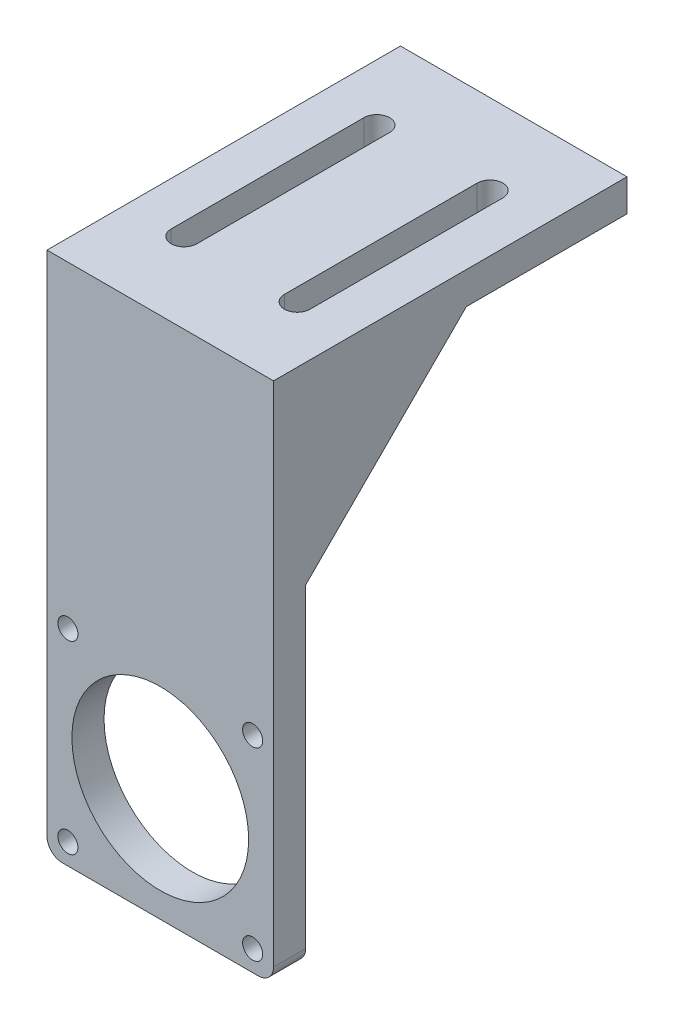
ISO-10303-21;
HEADER;
FILE_DESCRIPTION(('STEP AP214'),'2;1');
FILE_NAME('part.step','',(''),(''),'','','');
FILE_SCHEMA(('AUTOMOTIVE_DESIGN { 1 0 10303 214 1 1 1 1 }'));
ENDSEC;
DATA;
#1=APPLICATION_CONTEXT('core data for automotive mechanical design processes');
#2=APPLICATION_PROTOCOL_DEFINITION('international standard','automotive_design',2000,#1);
#3=PRODUCT_CONTEXT('',#1,'mechanical');
#4=PRODUCT('Part','Part','',(#3));
#5=PRODUCT_RELATED_PRODUCT_CATEGORY('part','',(#4));
#6=PRODUCT_DEFINITION_FORMATION('','',#4);
#7=PRODUCT_DEFINITION_CONTEXT('part definition',#1,'design');
#8=PRODUCT_DEFINITION('design','',#6,#7);
#9=PRODUCT_DEFINITION_SHAPE('','',#8);
#10=(LENGTH_UNIT() NAMED_UNIT(*) SI_UNIT(.MILLI.,.METRE.));
#11=(NAMED_UNIT(*) PLANE_ANGLE_UNIT() SI_UNIT($,.RADIAN.));
#12=(NAMED_UNIT(*) SI_UNIT($,.STERADIAN.) SOLID_ANGLE_UNIT());
#13=UNCERTAINTY_MEASURE_WITH_UNIT(LENGTH_MEASURE(1.E-05),#10,'distance_accuracy_value','');
#14=(GEOMETRIC_REPRESENTATION_CONTEXT(3) GLOBAL_UNCERTAINTY_ASSIGNED_CONTEXT((#13)) GLOBAL_UNIT_ASSIGNED_CONTEXT((#10,
#11,#12)) REPRESENTATION_CONTEXT('',''));
#15=CARTESIAN_POINT('',(0.,0.,0.));
#16=DIRECTION('',(0.,0.,1.));
#17=DIRECTION('',(1.,0.,0.));
#18=AXIS2_PLACEMENT_3D('',#15,#16,#17);
#19=CARTESIAN_POINT('',(-11.8505836409526,-14.3327512447559,0.));
#20=DIRECTION('',(0.,0.,-1.));
#21=DIRECTION('',(-1.,0.,0.));
#22=AXIS2_PLACEMENT_3D('',#19,#20,#21);
#23=PLANE('',#22);
#24=CARTESIAN_POINT('',(11.8492570349978,-13.6329105688056,0.));
#25=DIRECTION('',(0.,0.,1.));
#26=DIRECTION('',(1.,0.,0.));
#27=AXIS2_PLACEMENT_3D('',#24,#25,#26);
#28=CIRCLE('',#27,1.25);
#29=CARTESIAN_POINT('',(13.0992570349978,-13.6329105688056,0.));
#30=VERTEX_POINT('',#29);
#31=EDGE_CURVE('E301',#30,#30,#28,.T.);
#32=ORIENTED_EDGE('',*,*,#31,.T.);
#33=EDGE_LOOP('',(#32));
#34=FACE_BOUND('',#33,.T.);
#35=CARTESIAN_POINT('',(11.8492570349978,9.3670894311944,0.));
#36=DIRECTION('',(0.,0.,1.));
#37=DIRECTION('',(-1.,0.,0.));
#38=AXIS2_PLACEMENT_3D('',#35,#36,#37);
#39=CIRCLE('',#38,1.25);
#40=CARTESIAN_POINT('',(10.5992570349978,9.3670894311944,0.));
#41=VERTEX_POINT('',#40);
#42=EDGE_CURVE('E313',#41,#41,#39,.T.);
#43=ORIENTED_EDGE('',*,*,#42,.T.);
#44=EDGE_LOOP('',(#43));
#45=FACE_BOUND('',#44,.T.);
#46=CARTESIAN_POINT('',(-11.1507429650022,9.3670894311944,0.));
#47=DIRECTION('',(0.,0.,1.));
#48=DIRECTION('',(1.,0.,0.));
#49=AXIS2_PLACEMENT_3D('',#46,#47,#48);
#50=CIRCLE('',#49,1.25);
#51=CARTESIAN_POINT('',(-9.90074296500222,9.3670894311944,0.));
#52=VERTEX_POINT('',#51);
#53=EDGE_CURVE('E319',#52,#52,#50,.T.);
#54=ORIENTED_EDGE('',*,*,#53,.T.);
#55=EDGE_LOOP('',(#54));
#56=FACE_BOUND('',#55,.T.);
#57=CARTESIAN_POINT('',(-11.1507429650022,-13.6329105688056,0.));
#58=DIRECTION('',(0.,0.,1.));
#59=DIRECTION('',(-1.,0.,0.));
#60=AXIS2_PLACEMENT_3D('',#57,#58,#59);
#61=CIRCLE('',#60,1.25);
#62=CARTESIAN_POINT('',(-12.4007429650022,-13.6329105688056,0.));
#63=VERTEX_POINT('',#62);
#64=EDGE_CURVE('E307',#63,#63,#61,.T.);
#65=ORIENTED_EDGE('',*,*,#64,.T.);
#66=EDGE_LOOP('',(#65));
#67=FACE_BOUND('',#66,.T.);
#68=CARTESIAN_POINT('',(0.349257034997781,-2.13291056880559,0.));
#69=DIRECTION('',(0.,0.,1.));
#70=DIRECTION('',(1.,0.,0.));
#71=AXIS2_PLACEMENT_3D('',#68,#69,#70);
#72=CIRCLE('',#71,11.);
#73=CARTESIAN_POINT('',(11.3492570349978,-2.13291056880559,0.));
#74=VERTEX_POINT('',#73);
#75=EDGE_CURVE('E281',#74,#74,#72,.T.);
#76=ORIENTED_EDGE('',*,*,#75,.T.);
#77=EDGE_LOOP('',(#76));
#78=FACE_BOUND('',#77,.T.);
#79=DIRECTION('',(0.,-1.,0.));
#80=VECTOR('',#79,1.);
#81=CARTESIAN_POINT('',(-13.7507429650022,44.8670894311944,0.));
#82=LINE('',#81,#80);
#83=CARTESIAN_POINT('',(-13.7507429650022,24.8670894311944,0.));
#84=VERTEX_POINT('',#83);
#85=CARTESIAN_POINT('',(-13.7507429650022,-14.3327512447559,0.));
#86=VERTEX_POINT('',#85);
#87=EDGE_CURVE('E57',#84,#86,#82,.T.);
#88=ORIENTED_EDGE('',*,*,#87,.F.);
#89=DIRECTION('',(-1.,0.,0.));
#90=VECTOR('',#89,1.);
#91=CARTESIAN_POINT('',(-11.7507429650022,24.8670894311944,0.));
#92=LINE('',#91,#90);
#93=CARTESIAN_POINT('',(-11.7507429650022,24.8670894311944,0.));
#94=VERTEX_POINT('',#93);
#95=EDGE_CURVE('E52',#94,#84,#92,.T.);
#96=ORIENTED_EDGE('',*,*,#95,.F.);
#97=DIRECTION('',(0.,-1.,0.));
#98=VECTOR('',#97,1.);
#99=CARTESIAN_POINT('',(-11.7507429650022,44.8670894311944,0.));
#100=LINE('',#99,#98);
#101=CARTESIAN_POINT('',(-11.7507429650022,44.8670894311944,0.));
#102=VERTEX_POINT('',#101);
#103=EDGE_CURVE('E199',#102,#94,#100,.T.);
#104=ORIENTED_EDGE('',*,*,#103,.F.);
#105=DIRECTION('',(-1.,0.,0.));
#106=VECTOR('',#105,1.);
#107=CARTESIAN_POINT('',(14.4492570349978,44.8670894311944,0.));
#108=LINE('',#107,#106);
#109=CARTESIAN_POINT('',(12.4492570349978,44.8670894311944,0.));
#110=VERTEX_POINT('',#109);
#111=EDGE_CURVE('E346',#110,#102,#108,.T.);
#112=ORIENTED_EDGE('',*,*,#111,.F.);
#113=DIRECTION('',(0.,-1.,0.));
#114=VECTOR('',#113,1.);
#115=CARTESIAN_POINT('',(12.4492570349978,44.8670894311944,0.));
#116=LINE('',#115,#114);
#117=CARTESIAN_POINT('',(12.4492570349978,24.8670894311944,0.));
#118=VERTEX_POINT('',#117);
#119=EDGE_CURVE('E210',#110,#118,#116,.T.);
#120=ORIENTED_EDGE('',*,*,#119,.T.);
#121=DIRECTION('',(1.,0.,0.));
#122=VECTOR('',#121,1.);
#123=CARTESIAN_POINT('',(12.4492570349978,24.8670894311944,0.));
#124=LINE('',#123,#122);
#125=CARTESIAN_POINT('',(14.4492570349978,24.8670894311944,0.));
#126=VERTEX_POINT('',#125);
#127=EDGE_CURVE('E215',#118,#126,#124,.T.);
#128=ORIENTED_EDGE('',*,*,#127,.T.);
#129=DIRECTION('',(0.,1.,0.));
#130=VECTOR('',#129,1.);
#131=CARTESIAN_POINT('',(14.4492570349978,-14.3327512447559,0.));
#132=LINE('',#131,#130);
#133=CARTESIAN_POINT('',(14.4492570349978,-14.3327512447559,0.));
#134=VERTEX_POINT('',#133);
#135=EDGE_CURVE('E343',#134,#126,#132,.T.);
#136=ORIENTED_EDGE('',*,*,#135,.F.);
#137=CARTESIAN_POINT('',(12.5490977109481,-14.3327512447559,0.));
#138=DIRECTION('',(0.,0.,1.));
#139=DIRECTION('',(1.,0.,0.));
#140=AXIS2_PLACEMENT_3D('',#137,#138,#139);
#141=CIRCLE('',#140,1.90015932404967);
#142=CARTESIAN_POINT('',(12.5490977109481,-16.2329105688056,0.));
#143=VERTEX_POINT('',#142);
#144=EDGE_CURVE('E341',#143,#134,#141,.T.);
#145=ORIENTED_EDGE('',*,*,#144,.F.);
#146=DIRECTION('',(1.,0.,0.));
#147=VECTOR('',#146,1.);
#148=CARTESIAN_POINT('',(0.349257034997781,-16.2329105688056,0.));
#149=LINE('',#148,#147);
#150=CARTESIAN_POINT('',(-11.8505836409525,-16.2329105688056,0.));
#151=VERTEX_POINT('',#150);
#152=EDGE_CURVE('E325',#151,#143,#149,.T.);
#153=ORIENTED_EDGE('',*,*,#152,.F.);
#154=CARTESIAN_POINT('',(-11.8505836409526,-14.3327512447559,0.));
#155=DIRECTION('',(0.,0.,1.));
#156=DIRECTION('',(-1.,0.,0.));
#157=AXIS2_PLACEMENT_3D('',#154,#155,#156);
#158=CIRCLE('',#157,1.90015932404967);
#159=EDGE_CURVE('E331',#86,#151,#158,.T.);
#160=ORIENTED_EDGE('',*,*,#159,.F.);
#161=EDGE_LOOP('',(#88,#96,#104,#112,#120,#128,#136,#145,#153,#160));
#162=FACE_BOUND('',#161,.T.);
#163=ADVANCED_FACE('F37',(#34,#45,#56,#67,#78,#162),#23,.T.);
#164=CARTESIAN_POINT('',(0.,44.8670894311944,0.));
#165=DIRECTION('',(0.,1.,0.));
#166=DIRECTION('',(0.,0.,1.));
#167=AXIS2_PLACEMENT_3D('',#164,#165,#166);
#168=PLANE('',#167);
#169=CARTESIAN_POINT('',(7.39925703499778,44.8670894311944,-30.));
#170=DIRECTION('',(0.,1.,0.));
#171=DIRECTION('',(0.,0.,1.));
#172=AXIS2_PLACEMENT_3D('',#169,#170,#171);
#173=CIRCLE('',#172,1.6);
#174=CARTESIAN_POINT('',(8.99925703499778,44.8670894311944,-30.));
#175=VERTEX_POINT('',#174);
#176=CARTESIAN_POINT('',(5.79925703499778,44.8670894311944,-30.));
#177=VERTEX_POINT('',#176);
#178=EDGE_CURVE('E262',#175,#177,#173,.T.);
#179=ORIENTED_EDGE('',*,*,#178,.T.);
#180=DIRECTION('',(0.,0.,-1.));
#181=VECTOR('',#180,1.);
#182=CARTESIAN_POINT('',(5.79925703499778,44.8670894311944,0.));
#183=LINE('',#182,#181);
#184=CARTESIAN_POINT('',(5.79925703499778,44.8670894311944,-6.));
#185=VERTEX_POINT('',#184);
#186=EDGE_CURVE('E271',#185,#177,#183,.T.);
#187=ORIENTED_EDGE('',*,*,#186,.F.);
#188=CARTESIAN_POINT('',(7.39925703499778,44.8670894311944,-6.));
#189=DIRECTION('',(0.,1.,0.));
#190=DIRECTION('',(0.,0.,1.));
#191=AXIS2_PLACEMENT_3D('',#188,#189,#190);
#192=CIRCLE('',#191,1.6);
#193=CARTESIAN_POINT('',(8.99925703499778,44.8670894311944,-6.));
#194=VERTEX_POINT('',#193);
#195=EDGE_CURVE('E268',#194,#185,#192,.F.);
#196=ORIENTED_EDGE('',*,*,#195,.F.);
#197=DIRECTION('',(0.,0.,-1.));
#198=VECTOR('',#197,1.);
#199=CARTESIAN_POINT('',(8.99925703499778,44.8670894311944,0.));
#200=LINE('',#199,#198);
#201=EDGE_CURVE('E265',#194,#175,#200,.T.);
#202=ORIENTED_EDGE('',*,*,#201,.T.);
#203=EDGE_LOOP('',(#179,#187,#196,#202));
#204=FACE_BOUND('',#203,.T.);
#205=CARTESIAN_POINT('',(-6.70074296500222,44.8670894311944,-6.));
#206=DIRECTION('',(0.,1.,0.));
#207=DIRECTION('',(0.,0.,1.));
#208=AXIS2_PLACEMENT_3D('',#205,#206,#207);
#209=CIRCLE('',#208,1.6);
#210=CARTESIAN_POINT('',(-8.30074296500222,44.8670894311944,-6.));
#211=VERTEX_POINT('',#210);
#212=CARTESIAN_POINT('',(-5.10074296500222,44.8670894311944,-6.));
#213=VERTEX_POINT('',#212);
#214=EDGE_CURVE('E217',#211,#213,#209,.T.);
#215=ORIENTED_EDGE('',*,*,#214,.T.);
#216=DIRECTION('',(0.,0.,-1.));
#217=VECTOR('',#216,1.);
#218=CARTESIAN_POINT('',(-5.10074296500222,44.8670894311944,0.));
#219=LINE('',#218,#217);
#220=CARTESIAN_POINT('',(-5.10074296500222,44.8670894311944,-30.));
#221=VERTEX_POINT('',#220);
#222=EDGE_CURVE('E259',#213,#221,#219,.T.);
#223=ORIENTED_EDGE('',*,*,#222,.T.);
#224=CARTESIAN_POINT('',(-6.70074296500222,44.8670894311944,-30.));
#225=DIRECTION('',(0.,1.,0.));
#226=DIRECTION('',(0.,0.,1.));
#227=AXIS2_PLACEMENT_3D('',#224,#225,#226);
#228=CIRCLE('',#227,1.6);
#229=CARTESIAN_POINT('',(-8.30074296500222,44.8670894311944,-30.));
#230=VERTEX_POINT('',#229);
#231=EDGE_CURVE('E256',#230,#221,#228,.F.);
#232=ORIENTED_EDGE('',*,*,#231,.F.);
#233=DIRECTION('',(0.,0.,-1.));
#234=VECTOR('',#233,1.);
#235=CARTESIAN_POINT('',(-8.30074296500222,44.8670894311944,0.));
#236=LINE('',#235,#234);
#237=EDGE_CURVE('E254',#211,#230,#236,.T.);
#238=ORIENTED_EDGE('',*,*,#237,.F.);
#239=EDGE_LOOP('',(#215,#223,#232,#238));
#240=FACE_BOUND('',#239,.T.);
#241=DIRECTION('',(-1.,0.,0.));
#242=VECTOR('',#241,1.);
#243=CARTESIAN_POINT('',(-11.7507429650022,44.8670894311944,-20.));
#244=LINE('',#243,#242);
#245=CARTESIAN_POINT('',(-11.7507429650022,44.8670894311944,-20.));
#246=VERTEX_POINT('',#245);
#247=CARTESIAN_POINT('',(-13.7507429650022,44.8670894311944,-20.));
#248=VERTEX_POINT('',#247);
#249=EDGE_CURVE('E186',#246,#248,#244,.T.);
#250=ORIENTED_EDGE('',*,*,#249,.T.);
#251=DIRECTION('',(0.,0.,-1.));
#252=VECTOR('',#251,1.);
#253=CARTESIAN_POINT('',(-13.7507429650022,44.8670894311944,0.));
#254=LINE('',#253,#252);
#255=CARTESIAN_POINT('',(-13.7507429650022,44.8670894311944,-40.));
#256=VERTEX_POINT('',#255);
#257=EDGE_CURVE('E172',#248,#256,#254,.T.);
#258=ORIENTED_EDGE('',*,*,#257,.T.);
#259=DIRECTION('',(1.,0.,0.));
#260=VECTOR('',#259,1.);
#261=CARTESIAN_POINT('',(0.,44.8670894311944,-40.));
#262=LINE('',#261,#260);
#263=CARTESIAN_POINT('',(14.4492570349978,44.8670894311944,-40.));
#264=VERTEX_POINT('',#263);
#265=EDGE_CURVE('E183',#256,#264,#262,.T.);
#266=ORIENTED_EDGE('',*,*,#265,.T.);
#267=DIRECTION('',(0.,0.,1.));
#268=VECTOR('',#267,1.);
#269=CARTESIAN_POINT('',(14.4492570349978,44.8670894311944,0.));
#270=LINE('',#269,#268);
#271=CARTESIAN_POINT('',(14.4492570349978,44.8670894311944,-20.));
#272=VERTEX_POINT('',#271);
#273=EDGE_CURVE('E274',#264,#272,#270,.T.);
#274=ORIENTED_EDGE('',*,*,#273,.T.);
#275=DIRECTION('',(1.,0.,0.));
#276=VECTOR('',#275,1.);
#277=CARTESIAN_POINT('',(12.4492570349978,44.8670894311944,-20.));
#278=LINE('',#277,#276);
#279=CARTESIAN_POINT('',(12.4492570349978,44.8670894311944,-20.));
#280=VERTEX_POINT('',#279);
#281=EDGE_CURVE('E212',#280,#272,#278,.T.);
#282=ORIENTED_EDGE('',*,*,#281,.F.);
#283=DIRECTION('',(0.,0.,1.));
#284=VECTOR('',#283,1.);
#285=CARTESIAN_POINT('',(12.4492570349978,44.8670894311944,-20.));
#286=LINE('',#285,#284);
#287=EDGE_CURVE('E208',#280,#110,#286,.T.);
#288=ORIENTED_EDGE('',*,*,#287,.T.);
#289=ORIENTED_EDGE('',*,*,#111,.T.);
#290=DIRECTION('',(0.,0.,1.));
#291=VECTOR('',#290,1.);
#292=CARTESIAN_POINT('',(-11.7507429650022,44.8670894311944,-20.));
#293=LINE('',#292,#291);
#294=EDGE_CURVE('E190',#246,#102,#293,.T.);
#295=ORIENTED_EDGE('',*,*,#294,.F.);
#296=EDGE_LOOP('',(#250,#258,#266,#274,#282,#288,#289,#295));
#297=FACE_BOUND('',#296,.T.);
#298=ADVANCED_FACE('F187',(#204,#240,#297),#168,.F.);
#299=CARTESIAN_POINT('',(-11.8505836409526,-14.3327512447559,4.));
#300=DIRECTION('',(0.,0.,-1.));
#301=DIRECTION('',(-1.,0.,0.));
#302=AXIS2_PLACEMENT_3D('',#299,#300,#301);
#303=PLANE('',#302);
#304=DIRECTION('',(1.,0.,0.));
#305=VECTOR('',#304,1.);
#306=CARTESIAN_POINT('',(0.349257034997781,-16.2329105688056,4.));
#307=LINE('',#306,#305);
#308=CARTESIAN_POINT('',(-11.8505836409525,-16.2329105688056,4.));
#309=VERTEX_POINT('',#308);
#310=CARTESIAN_POINT('',(12.5490977109481,-16.2329105688056,4.));
#311=VERTEX_POINT('',#310);
#312=EDGE_CURVE('E328',#309,#311,#307,.T.);
#313=ORIENTED_EDGE('',*,*,#312,.T.);
#314=CARTESIAN_POINT('',(12.5490977109481,-14.3327512447559,4.));
#315=DIRECTION('',(0.,0.,1.));
#316=DIRECTION('',(1.,0.,0.));
#317=AXIS2_PLACEMENT_3D('',#314,#315,#316);
#318=CIRCLE('',#317,1.90015932404967);
#319=CARTESIAN_POINT('',(14.4492570349978,-14.3327512447559,4.));
#320=VERTEX_POINT('',#319);
#321=EDGE_CURVE('E330',#311,#320,#318,.T.);
#322=ORIENTED_EDGE('',*,*,#321,.T.);
#323=DIRECTION('',(0.,1.,0.));
#324=VECTOR('',#323,1.);
#325=CARTESIAN_POINT('',(14.4492570349978,-14.3327512447559,4.));
#326=LINE('',#325,#324);
#327=CARTESIAN_POINT('',(14.4492570349978,48.8670894311944,4.));
#328=VERTEX_POINT('',#327);
#329=EDGE_CURVE('E333',#320,#328,#326,.T.);
#330=ORIENTED_EDGE('',*,*,#329,.T.);
#331=DIRECTION('',(-1.,0.,0.));
#332=VECTOR('',#331,1.);
#333=CARTESIAN_POINT('',(0.,48.8670894311944,4.));
#334=LINE('',#333,#332);
#335=CARTESIAN_POINT('',(-13.7507429650022,48.8670894311944,4.));
#336=VERTEX_POINT('',#335);
#337=EDGE_CURVE('E248',#328,#336,#334,.T.);
#338=ORIENTED_EDGE('',*,*,#337,.T.);
#339=DIRECTION('',(0.,-1.,0.));
#340=VECTOR('',#339,1.);
#341=CARTESIAN_POINT('',(-13.7507429650022,44.8670894311944,4.));
#342=LINE('',#341,#340);
#343=CARTESIAN_POINT('',(-13.7507429650022,-14.3327512447559,4.));
#344=VERTEX_POINT('',#343);
#345=EDGE_CURVE('E335',#336,#344,#342,.T.);
#346=ORIENTED_EDGE('',*,*,#345,.T.);
#347=CARTESIAN_POINT('',(-11.8505836409526,-14.3327512447559,4.));
#348=DIRECTION('',(0.,0.,1.));
#349=DIRECTION('',(-1.,0.,0.));
#350=AXIS2_PLACEMENT_3D('',#347,#348,#349);
#351=CIRCLE('',#350,1.90015932404967);
#352=EDGE_CURVE('E337',#344,#309,#351,.T.);
#353=ORIENTED_EDGE('',*,*,#352,.T.);
#354=EDGE_LOOP('',(#313,#322,#330,#338,#346,#353));
#355=FACE_BOUND('',#354,.T.);
#356=CARTESIAN_POINT('',(-11.1507429650022,9.3670894311944,4.));
#357=DIRECTION('',(0.,0.,1.));
#358=DIRECTION('',(1.,0.,0.));
#359=AXIS2_PLACEMENT_3D('',#356,#357,#358);
#360=CIRCLE('',#359,1.25);
#361=CARTESIAN_POINT('',(-9.90074296500222,9.3670894311944,4.));
#362=VERTEX_POINT('',#361);
#363=EDGE_CURVE('E322',#362,#362,#360,.T.);
#364=ORIENTED_EDGE('',*,*,#363,.F.);
#365=EDGE_LOOP('',(#364));
#366=FACE_BOUND('',#365,.T.);
#367=CARTESIAN_POINT('',(11.8492570349978,9.3670894311944,4.));
#368=DIRECTION('',(0.,0.,1.));
#369=DIRECTION('',(-1.,0.,0.));
#370=AXIS2_PLACEMENT_3D('',#367,#368,#369);
#371=CIRCLE('',#370,1.25);
#372=CARTESIAN_POINT('',(10.5992570349978,9.3670894311944,4.));
#373=VERTEX_POINT('',#372);
#374=EDGE_CURVE('E316',#373,#373,#371,.T.);
#375=ORIENTED_EDGE('',*,*,#374,.F.);
#376=EDGE_LOOP('',(#375));
#377=FACE_BOUND('',#376,.T.);
#378=CARTESIAN_POINT('',(-11.1507429650022,-13.6329105688056,4.));
#379=DIRECTION('',(0.,0.,1.));
#380=DIRECTION('',(-1.,0.,0.));
#381=AXIS2_PLACEMENT_3D('',#378,#379,#380);
#382=CIRCLE('',#381,1.25);
#383=CARTESIAN_POINT('',(-12.4007429650022,-13.6329105688056,4.));
#384=VERTEX_POINT('',#383);
#385=EDGE_CURVE('E310',#384,#384,#382,.T.);
#386=ORIENTED_EDGE('',*,*,#385,.F.);
#387=EDGE_LOOP('',(#386));
#388=FACE_BOUND('',#387,.T.);
#389=CARTESIAN_POINT('',(11.8492570349978,-13.6329105688056,4.));
#390=DIRECTION('',(0.,0.,1.));
#391=DIRECTION('',(1.,0.,0.));
#392=AXIS2_PLACEMENT_3D('',#389,#390,#391);
#393=CIRCLE('',#392,1.25);
#394=CARTESIAN_POINT('',(13.0992570349978,-13.6329105688056,4.));
#395=VERTEX_POINT('',#394);
#396=EDGE_CURVE('E304',#395,#395,#393,.T.);
#397=ORIENTED_EDGE('',*,*,#396,.F.);
#398=EDGE_LOOP('',(#397));
#399=FACE_BOUND('',#398,.T.);
#400=CARTESIAN_POINT('',(0.349257034997781,-2.13291056880559,4.));
#401=DIRECTION('',(0.,0.,1.));
#402=DIRECTION('',(1.,0.,0.));
#403=AXIS2_PLACEMENT_3D('',#400,#401,#402);
#404=CIRCLE('',#403,11.);
#405=CARTESIAN_POINT('',(11.3492570349978,-2.13291056880559,4.));
#406=VERTEX_POINT('',#405);
#407=EDGE_CURVE('E298',#406,#406,#404,.T.);
#408=ORIENTED_EDGE('',*,*,#407,.F.);
#409=EDGE_LOOP('',(#408));
#410=FACE_BOUND('',#409,.T.);
#411=ADVANCED_FACE('F388',(#355,#366,#377,#388,#399,#410),#303,.F.);
#412=CARTESIAN_POINT('',(0.349257034997781,-16.2329105688056,4.));
#413=DIRECTION('',(0.,1.,0.));
#414=DIRECTION('',(0.,0.,1.));
#415=AXIS2_PLACEMENT_3D('',#412,#413,#414);
#416=PLANE('',#415);
#417=ORIENTED_EDGE('',*,*,#152,.T.);
#418=DIRECTION('',(0.,0.,-1.));
#419=VECTOR('',#418,1.);
#420=CARTESIAN_POINT('',(12.5490977109481,-16.2329105688056,4.));
#421=LINE('',#420,#419);
#422=EDGE_CURVE('E11',#311,#143,#421,.T.);
#423=ORIENTED_EDGE('',*,*,#422,.F.);
#424=ORIENTED_EDGE('',*,*,#312,.F.);
#425=DIRECTION('',(0.,0.,-1.));
#426=VECTOR('',#425,1.);
#427=CARTESIAN_POINT('',(-11.8505836409525,-16.2329105688056,4.));
#428=LINE('',#427,#426);
#429=EDGE_CURVE('E339',#309,#151,#428,.T.);
#430=ORIENTED_EDGE('',*,*,#429,.T.);
#431=EDGE_LOOP('',(#417,#423,#424,#430));
#432=FACE_BOUND('',#431,.T.);
#433=ADVANCED_FACE('F39',(#432),#416,.F.);
#434=CARTESIAN_POINT('',(12.5490977109481,-14.3327512447559,4.));
#435=DIRECTION('',(0.,0.,-1.));
#436=DIRECTION('',(-1.,0.,0.));
#437=AXIS2_PLACEMENT_3D('',#434,#435,#436);
#438=CYLINDRICAL_SURFACE('',#437,1.90015932404967);
#439=ORIENTED_EDGE('',*,*,#144,.T.);
#440=DIRECTION('',(0.,0.,-1.));
#441=VECTOR('',#440,1.);
#442=CARTESIAN_POINT('',(14.4492570349978,-14.3327512447559,4.));
#443=LINE('',#442,#441);
#444=EDGE_CURVE('E45',#320,#134,#443,.T.);
#445=ORIENTED_EDGE('',*,*,#444,.F.);
#446=ORIENTED_EDGE('',*,*,#321,.F.);
#447=ORIENTED_EDGE('',*,*,#422,.T.);
#448=EDGE_LOOP('',(#439,#445,#446,#447));
#449=FACE_BOUND('',#448,.T.);
#450=ADVANCED_FACE('F403',(#449),#438,.T.);
#451=CARTESIAN_POINT('',(14.4492570349978,-14.3327512447559,4.));
#452=DIRECTION('',(-1.,0.,0.));
#453=DIRECTION('',(0.,0.,1.));
#454=AXIS2_PLACEMENT_3D('',#451,#452,#453);
#455=PLANE('',#454);
#456=ORIENTED_EDGE('',*,*,#135,.T.);
#457=DIRECTION('',(0.,0.707106781186548,-0.707106781186548));
#458=VECTOR('',#457,1.);
#459=CARTESIAN_POINT('',(14.4492570349978,24.8670894311944,0.));
#460=LINE('',#459,#458);
#461=EDGE_CURVE('E194',#126,#272,#460,.T.);
#462=ORIENTED_EDGE('',*,*,#461,.T.);
#463=ORIENTED_EDGE('',*,*,#273,.F.);
#464=DIRECTION('',(0.,-1.,0.));
#465=VECTOR('',#464,1.);
#466=CARTESIAN_POINT('',(14.4492570349978,48.8670894311944,-40.));
#467=LINE('',#466,#465);
#468=CARTESIAN_POINT('',(14.4492570349978,48.8670894311944,-40.));
#469=VERTEX_POINT('',#468);
#470=EDGE_CURVE('E278',#469,#264,#467,.T.);
#471=ORIENTED_EDGE('',*,*,#470,.F.);
#472=DIRECTION('',(0.,0.,1.));
#473=VECTOR('',#472,1.);
#474=CARTESIAN_POINT('',(14.4492570349978,48.8670894311944,0.));
#475=LINE('',#474,#473);
#476=EDGE_CURVE('E240',#469,#328,#475,.T.);
#477=ORIENTED_EDGE('',*,*,#476,.T.);
#478=ORIENTED_EDGE('',*,*,#329,.F.);
#479=ORIENTED_EDGE('',*,*,#444,.T.);
#480=EDGE_LOOP('',(#456,#462,#463,#471,#477,#478,#479));
#481=FACE_BOUND('',#480,.T.);
#482=ADVANCED_FACE('F360',(#481),#455,.F.);
#483=CARTESIAN_POINT('',(-13.7507429650022,44.8670894311944,4.));
#484=DIRECTION('',(1.,0.,0.));
#485=DIRECTION('',(0.,0.,-1.));
#486=AXIS2_PLACEMENT_3D('',#483,#484,#485);
#487=PLANE('',#486);
#488=DIRECTION('',(0.,0.707106781186548,-0.707106781186548));
#489=VECTOR('',#488,1.);
#490=CARTESIAN_POINT('',(-13.7507429650022,24.8670894311944,0.));
#491=LINE('',#490,#489);
#492=EDGE_CURVE('E176',#84,#248,#491,.T.);
#493=ORIENTED_EDGE('',*,*,#492,.F.);
#494=ORIENTED_EDGE('',*,*,#87,.T.);
#495=DIRECTION('',(0.,0.,-1.));
#496=VECTOR('',#495,1.);
#497=CARTESIAN_POINT('',(-13.7507429650022,-14.3327512447559,4.));
#498=LINE('',#497,#496);
#499=EDGE_CURVE('E353',#344,#86,#498,.T.);
#500=ORIENTED_EDGE('',*,*,#499,.F.);
#501=ORIENTED_EDGE('',*,*,#345,.F.);
#502=DIRECTION('',(0.,0.,-1.));
#503=VECTOR('',#502,1.);
#504=CARTESIAN_POINT('',(-13.7507429650022,48.8670894311944,0.));
#505=LINE('',#504,#503);
#506=CARTESIAN_POINT('',(-13.7507429650022,48.8670894311944,-40.));
#507=VERTEX_POINT('',#506);
#508=EDGE_CURVE('E246',#336,#507,#505,.T.);
#509=ORIENTED_EDGE('',*,*,#508,.T.);
#510=DIRECTION('',(0.,-1.,0.));
#511=VECTOR('',#510,1.);
#512=CARTESIAN_POINT('',(-13.7507429650022,48.8670894311944,-40.));
#513=LINE('',#512,#511);
#514=EDGE_CURVE('E178',#507,#256,#513,.T.);
#515=ORIENTED_EDGE('',*,*,#514,.T.);
#516=ORIENTED_EDGE('',*,*,#257,.F.);
#517=EDGE_LOOP('',(#493,#494,#500,#501,#509,#515,#516));
#518=FACE_BOUND('',#517,.T.);
#519=ADVANCED_FACE('F174',(#518),#487,.F.);
#520=CARTESIAN_POINT('',(-11.8505836409526,-14.3327512447559,4.));
#521=DIRECTION('',(0.,0.,-1.));
#522=DIRECTION('',(-1.,0.,0.));
#523=AXIS2_PLACEMENT_3D('',#520,#521,#522);
#524=CYLINDRICAL_SURFACE('',#523,1.90015932404967);
#525=ORIENTED_EDGE('',*,*,#159,.T.);
#526=ORIENTED_EDGE('',*,*,#429,.F.);
#527=ORIENTED_EDGE('',*,*,#352,.F.);
#528=ORIENTED_EDGE('',*,*,#499,.T.);
#529=EDGE_LOOP('',(#525,#526,#527,#528));
#530=FACE_BOUND('',#529,.T.);
#531=ADVANCED_FACE('F395',(#530),#524,.T.);
#532=CARTESIAN_POINT('',(-11.1507429650022,9.3670894311944,4.));
#533=DIRECTION('',(0.,0.,-1.));
#534=DIRECTION('',(-1.,0.,0.));
#535=AXIS2_PLACEMENT_3D('',#532,#533,#534);
#536=CYLINDRICAL_SURFACE('',#535,1.25);
#537=ORIENTED_EDGE('',*,*,#363,.T.);
#538=EDGE_LOOP('',(#537));
#539=FACE_BOUND('',#538,.T.);
#540=ORIENTED_EDGE('',*,*,#53,.F.);
#541=EDGE_LOOP('',(#540));
#542=FACE_BOUND('',#541,.T.);
#543=ADVANCED_FACE('F398',(#539,#542),#536,.F.);
#544=CARTESIAN_POINT('',(11.8492570349978,9.3670894311944,4.));
#545=DIRECTION('',(0.,0.,-1.));
#546=DIRECTION('',(-1.,0.,0.));
#547=AXIS2_PLACEMENT_3D('',#544,#545,#546);
#548=CYLINDRICAL_SURFACE('',#547,1.25);
#549=ORIENTED_EDGE('',*,*,#374,.T.);
#550=EDGE_LOOP('',(#549));
#551=FACE_BOUND('',#550,.T.);
#552=ORIENTED_EDGE('',*,*,#42,.F.);
#553=EDGE_LOOP('',(#552));
#554=FACE_BOUND('',#553,.T.);
#555=ADVANCED_FACE('F474',(#551,#554),#548,.F.);
#556=CARTESIAN_POINT('',(-11.1507429650022,-13.6329105688056,4.));
#557=DIRECTION('',(0.,0.,-1.));
#558=DIRECTION('',(-1.,0.,0.));
#559=AXIS2_PLACEMENT_3D('',#556,#557,#558);
#560=CYLINDRICAL_SURFACE('',#559,1.25);
#561=ORIENTED_EDGE('',*,*,#385,.T.);
#562=EDGE_LOOP('',(#561));
#563=FACE_BOUND('',#562,.T.);
#564=ORIENTED_EDGE('',*,*,#64,.F.);
#565=EDGE_LOOP('',(#564));
#566=FACE_BOUND('',#565,.T.);
#567=ADVANCED_FACE('F470',(#563,#566),#560,.F.);
#568=CARTESIAN_POINT('',(11.8492570349978,-13.6329105688056,4.));
#569=DIRECTION('',(0.,0.,-1.));
#570=DIRECTION('',(-1.,0.,0.));
#571=AXIS2_PLACEMENT_3D('',#568,#569,#570);
#572=CYLINDRICAL_SURFACE('',#571,1.25);
#573=ORIENTED_EDGE('',*,*,#396,.T.);
#574=EDGE_LOOP('',(#573));
#575=FACE_BOUND('',#574,.T.);
#576=ORIENTED_EDGE('',*,*,#31,.F.);
#577=EDGE_LOOP('',(#576));
#578=FACE_BOUND('',#577,.T.);
#579=ADVANCED_FACE('F436',(#575,#578),#572,.F.);
#580=CARTESIAN_POINT('',(0.349257034997781,-2.13291056880559,4.));
#581=DIRECTION('',(0.,0.,-1.));
#582=DIRECTION('',(-1.,0.,0.));
#583=AXIS2_PLACEMENT_3D('',#580,#581,#582);
#584=CYLINDRICAL_SURFACE('',#583,11.);
#585=ORIENTED_EDGE('',*,*,#407,.T.);
#586=EDGE_LOOP('',(#585));
#587=FACE_BOUND('',#586,.T.);
#588=ORIENTED_EDGE('',*,*,#75,.F.);
#589=EDGE_LOOP('',(#588));
#590=FACE_BOUND('',#589,.T.);
#591=ADVANCED_FACE('F427',(#587,#590),#584,.F.);
#592=CARTESIAN_POINT('',(0.,48.8670894311944,-40.));
#593=DIRECTION('',(0.,0.,-1.));
#594=DIRECTION('',(-1.,0.,0.));
#595=AXIS2_PLACEMENT_3D('',#592,#593,#594);
#596=PLANE('',#595);
#597=ORIENTED_EDGE('',*,*,#265,.F.);
#598=ORIENTED_EDGE('',*,*,#514,.F.);
#599=DIRECTION('',(1.,0.,0.));
#600=VECTOR('',#599,1.);
#601=CARTESIAN_POINT('',(0.,48.8670894311944,-40.));
#602=LINE('',#601,#600);
#603=EDGE_CURVE('E243',#507,#469,#602,.T.);
#604=ORIENTED_EDGE('',*,*,#603,.T.);
#605=ORIENTED_EDGE('',*,*,#470,.T.);
#606=EDGE_LOOP('',(#597,#598,#604,#605));
#607=FACE_BOUND('',#606,.T.);
#608=ADVANCED_FACE('F424',(#607),#596,.T.);
#609=CARTESIAN_POINT('',(7.39925703499778,48.8670894311944,-30.));
#610=DIRECTION('',(0.,-1.,0.));
#611=DIRECTION('',(0.,0.,-1.));
#612=AXIS2_PLACEMENT_3D('',#609,#610,#611);
#613=CYLINDRICAL_SURFACE('',#612,1.6);
#614=ORIENTED_EDGE('',*,*,#178,.F.);
#615=DIRECTION('',(0.,-1.,0.));
#616=VECTOR('',#615,1.);
#617=CARTESIAN_POINT('',(8.99925703499778,48.8670894311944,-30.));
#618=LINE('',#617,#616);
#619=CARTESIAN_POINT('',(8.99925703499778,48.8670894311944,-30.));
#620=VERTEX_POINT('',#619);
#621=EDGE_CURVE('E279',#620,#175,#618,.T.);
#622=ORIENTED_EDGE('',*,*,#621,.F.);
#623=CARTESIAN_POINT('',(7.39925703499778,48.8670894311944,-30.));
#624=DIRECTION('',(0.,1.,0.));
#625=DIRECTION('',(0.,0.,1.));
#626=AXIS2_PLACEMENT_3D('',#623,#624,#625);
#627=CIRCLE('',#626,1.6);
#628=CARTESIAN_POINT('',(5.79925703499778,48.8670894311944,-30.));
#629=VERTEX_POINT('',#628);
#630=EDGE_CURVE('E229',#620,#629,#627,.T.);
#631=ORIENTED_EDGE('',*,*,#630,.T.);
#632=DIRECTION('',(0.,-1.,0.));
#633=VECTOR('',#632,1.);
#634=CARTESIAN_POINT('',(5.79925703499778,48.8670894311944,-30.));
#635=LINE('',#634,#633);
#636=EDGE_CURVE('E282',#629,#177,#635,.T.);
#637=ORIENTED_EDGE('',*,*,#636,.T.);
#638=EDGE_LOOP('',(#614,#622,#631,#637));
#639=FACE_BOUND('',#638,.T.);
#640=ADVANCED_FACE('F426',(#639),#613,.F.);
#641=CARTESIAN_POINT('',(8.99925703499778,48.8670894311944,0.));
#642=DIRECTION('',(-1.,0.,0.));
#643=DIRECTION('',(0.,0.,1.));
#644=AXIS2_PLACEMENT_3D('',#641,#642,#643);
#645=PLANE('',#644);
#646=ORIENTED_EDGE('',*,*,#201,.F.);
#647=DIRECTION('',(0.,-1.,0.));
#648=VECTOR('',#647,1.);
#649=CARTESIAN_POINT('',(8.99925703499778,48.8670894311944,-6.));
#650=LINE('',#649,#648);
#651=CARTESIAN_POINT('',(8.99925703499778,48.8670894311944,-6.));
#652=VERTEX_POINT('',#651);
#653=EDGE_CURVE('E288',#652,#194,#650,.T.);
#654=ORIENTED_EDGE('',*,*,#653,.F.);
#655=DIRECTION('',(0.,0.,-1.));
#656=VECTOR('',#655,1.);
#657=CARTESIAN_POINT('',(8.99925703499778,48.8670894311944,0.));
#658=LINE('',#657,#656);
#659=EDGE_CURVE('E232',#652,#620,#658,.T.);
#660=ORIENTED_EDGE('',*,*,#659,.T.);
#661=ORIENTED_EDGE('',*,*,#621,.T.);
#662=EDGE_LOOP('',(#646,#654,#660,#661));
#663=FACE_BOUND('',#662,.T.);
#664=ADVANCED_FACE('F433',(#663),#645,.T.);
#665=CARTESIAN_POINT('',(7.39925703499778,48.8670894311944,-6.));
#666=DIRECTION('',(0.,-1.,0.));
#667=DIRECTION('',(0.,0.,-1.));
#668=AXIS2_PLACEMENT_3D('',#665,#666,#667);
#669=CYLINDRICAL_SURFACE('',#668,1.6);
#670=ORIENTED_EDGE('',*,*,#195,.T.);
#671=DIRECTION('',(0.,-1.,0.));
#672=VECTOR('',#671,1.);
#673=CARTESIAN_POINT('',(5.79925703499778,48.8670894311944,-6.));
#674=LINE('',#673,#672);
#675=CARTESIAN_POINT('',(5.79925703499778,48.8670894311944,-6.));
#676=VERTEX_POINT('',#675);
#677=EDGE_CURVE('E284',#676,#185,#674,.T.);
#678=ORIENTED_EDGE('',*,*,#677,.F.);
#679=CARTESIAN_POINT('',(7.39925703499778,48.8670894311944,-6.));
#680=DIRECTION('',(0.,1.,0.));
#681=DIRECTION('',(0.,0.,1.));
#682=AXIS2_PLACEMENT_3D('',#679,#680,#681);
#683=CIRCLE('',#682,1.6);
#684=EDGE_CURVE('E235',#652,#676,#683,.F.);
#685=ORIENTED_EDGE('',*,*,#684,.F.);
#686=ORIENTED_EDGE('',*,*,#653,.T.);
#687=EDGE_LOOP('',(#670,#678,#685,#686));
#688=FACE_BOUND('',#687,.T.);
#689=ADVANCED_FACE('F447',(#688),#669,.F.);
#690=CARTESIAN_POINT('',(-6.70074296500222,48.8670894311944,-6.));
#691=DIRECTION('',(0.,-1.,0.));
#692=DIRECTION('',(0.,0.,-1.));
#693=AXIS2_PLACEMENT_3D('',#690,#691,#692);
#694=CYLINDRICAL_SURFACE('',#693,1.6);
#695=ORIENTED_EDGE('',*,*,#214,.F.);
#696=DIRECTION('',(0.,-1.,0.));
#697=VECTOR('',#696,1.);
#698=CARTESIAN_POINT('',(-8.30074296500222,48.8670894311944,-6.));
#699=LINE('',#698,#697);
#700=CARTESIAN_POINT('',(-8.30074296500222,48.8670894311944,-6.));
#701=VERTEX_POINT('',#700);
#702=EDGE_CURVE('E285',#701,#211,#699,.T.);
#703=ORIENTED_EDGE('',*,*,#702,.F.);
#704=CARTESIAN_POINT('',(-6.70074296500222,48.8670894311944,-6.));
#705=DIRECTION('',(0.,1.,0.));
#706=DIRECTION('',(0.,0.,1.));
#707=AXIS2_PLACEMENT_3D('',#704,#705,#706);
#708=CIRCLE('',#707,1.6);
#709=CARTESIAN_POINT('',(-5.10074296500222,48.8670894311944,-6.));
#710=VERTEX_POINT('',#709);
#711=EDGE_CURVE('E182',#701,#710,#708,.T.);
#712=ORIENTED_EDGE('',*,*,#711,.T.);
#713=DIRECTION('',(0.,-1.,0.));
#714=VECTOR('',#713,1.);
#715=CARTESIAN_POINT('',(-5.10074296500222,48.8670894311944,-6.));
#716=LINE('',#715,#714);
#717=EDGE_CURVE('E251',#710,#213,#716,.T.);
#718=ORIENTED_EDGE('',*,*,#717,.T.);
#719=EDGE_LOOP('',(#695,#703,#712,#718));
#720=FACE_BOUND('',#719,.T.);
#721=ADVANCED_FACE('F450',(#720),#694,.F.);
#722=CARTESIAN_POINT('',(-8.30074296500222,48.8670894311944,0.));
#723=DIRECTION('',(-1.,0.,0.));
#724=DIRECTION('',(0.,0.,1.));
#725=AXIS2_PLACEMENT_3D('',#722,#723,#724);
#726=PLANE('',#725);
#727=ORIENTED_EDGE('',*,*,#237,.T.);
#728=DIRECTION('',(0.,-1.,0.));
#729=VECTOR('',#728,1.);
#730=CARTESIAN_POINT('',(-8.30074296500222,48.8670894311944,-30.));
#731=LINE('',#730,#729);
#732=CARTESIAN_POINT('',(-8.30074296500222,48.8670894311944,-30.));
#733=VERTEX_POINT('',#732);
#734=EDGE_CURVE('E294',#733,#230,#731,.T.);
#735=ORIENTED_EDGE('',*,*,#734,.F.);
#736=DIRECTION('',(0.,0.,-1.));
#737=VECTOR('',#736,1.);
#738=CARTESIAN_POINT('',(-8.30074296500222,48.8670894311944,0.));
#739=LINE('',#738,#737);
#740=EDGE_CURVE('E222',#701,#733,#739,.T.);
#741=ORIENTED_EDGE('',*,*,#740,.F.);
#742=ORIENTED_EDGE('',*,*,#702,.T.);
#743=EDGE_LOOP('',(#727,#735,#741,#742));
#744=FACE_BOUND('',#743,.T.);
#745=ADVANCED_FACE('F460',(#744),#726,.F.);
#746=CARTESIAN_POINT('',(-6.70074296500222,48.8670894311944,-30.));
#747=DIRECTION('',(0.,-1.,0.));
#748=DIRECTION('',(0.,0.,-1.));
#749=AXIS2_PLACEMENT_3D('',#746,#747,#748);
#750=CYLINDRICAL_SURFACE('',#749,1.6);
#751=ORIENTED_EDGE('',*,*,#231,.T.);
#752=DIRECTION('',(0.,-1.,0.));
#753=VECTOR('',#752,1.);
#754=CARTESIAN_POINT('',(-5.10074296500222,48.8670894311944,-30.));
#755=LINE('',#754,#753);
#756=CARTESIAN_POINT('',(-5.10074296500222,48.8670894311944,-30.));
#757=VERTEX_POINT('',#756);
#758=EDGE_CURVE('E292',#757,#221,#755,.T.);
#759=ORIENTED_EDGE('',*,*,#758,.F.);
#760=CARTESIAN_POINT('',(-6.70074296500222,48.8670894311944,-30.));
#761=DIRECTION('',(0.,1.,0.));
#762=DIRECTION('',(0.,0.,1.));
#763=AXIS2_PLACEMENT_3D('',#760,#761,#762);
#764=CIRCLE('',#763,1.6);
#765=EDGE_CURVE('E224',#733,#757,#764,.F.);
#766=ORIENTED_EDGE('',*,*,#765,.F.);
#767=ORIENTED_EDGE('',*,*,#734,.T.);
#768=EDGE_LOOP('',(#751,#759,#766,#767));
#769=FACE_BOUND('',#768,.T.);
#770=ADVANCED_FACE('F445',(#769),#750,.F.);
#771=CARTESIAN_POINT('',(5.79925703499778,48.8670894311944,0.));
#772=DIRECTION('',(-1.,0.,0.));
#773=DIRECTION('',(0.,0.,1.));
#774=AXIS2_PLACEMENT_3D('',#771,#772,#773);
#775=PLANE('',#774);
#776=ORIENTED_EDGE('',*,*,#186,.T.);
#777=ORIENTED_EDGE('',*,*,#636,.F.);
#778=DIRECTION('',(0.,0.,-1.));
#779=VECTOR('',#778,1.);
#780=CARTESIAN_POINT('',(5.79925703499778,48.8670894311944,0.));
#781=LINE('',#780,#779);
#782=EDGE_CURVE('E238',#676,#629,#781,.T.);
#783=ORIENTED_EDGE('',*,*,#782,.F.);
#784=ORIENTED_EDGE('',*,*,#677,.T.);
#785=EDGE_LOOP('',(#776,#777,#783,#784));
#786=FACE_BOUND('',#785,.T.);
#787=ADVANCED_FACE('F441',(#786),#775,.F.);
#788=CARTESIAN_POINT('',(-5.10074296500222,48.8670894311944,0.));
#789=DIRECTION('',(-1.,0.,0.));
#790=DIRECTION('',(0.,0.,1.));
#791=AXIS2_PLACEMENT_3D('',#788,#789,#790);
#792=PLANE('',#791);
#793=ORIENTED_EDGE('',*,*,#222,.F.);
#794=ORIENTED_EDGE('',*,*,#717,.F.);
#795=DIRECTION('',(0.,0.,-1.));
#796=VECTOR('',#795,1.);
#797=CARTESIAN_POINT('',(-5.10074296500222,48.8670894311944,0.));
#798=LINE('',#797,#796);
#799=EDGE_CURVE('E226',#710,#757,#798,.T.);
#800=ORIENTED_EDGE('',*,*,#799,.T.);
#801=ORIENTED_EDGE('',*,*,#758,.T.);
#802=EDGE_LOOP('',(#793,#794,#800,#801));
#803=FACE_BOUND('',#802,.T.);
#804=ADVANCED_FACE('F444',(#803),#792,.T.);
#805=CARTESIAN_POINT('',(0.,48.8670894311944,0.));
#806=DIRECTION('',(0.,1.,0.));
#807=DIRECTION('',(0.,0.,1.));
#808=AXIS2_PLACEMENT_3D('',#805,#806,#807);
#809=PLANE('',#808);
#810=ORIENTED_EDGE('',*,*,#711,.F.);
#811=ORIENTED_EDGE('',*,*,#740,.T.);
#812=ORIENTED_EDGE('',*,*,#765,.T.);
#813=ORIENTED_EDGE('',*,*,#799,.F.);
#814=EDGE_LOOP('',(#810,#811,#812,#813));
#815=FACE_BOUND('',#814,.T.);
#816=ORIENTED_EDGE('',*,*,#630,.F.);
#817=ORIENTED_EDGE('',*,*,#659,.F.);
#818=ORIENTED_EDGE('',*,*,#684,.T.);
#819=ORIENTED_EDGE('',*,*,#782,.T.);
#820=EDGE_LOOP('',(#816,#817,#818,#819));
#821=FACE_BOUND('',#820,.T.);
#822=ORIENTED_EDGE('',*,*,#476,.F.);
#823=ORIENTED_EDGE('',*,*,#603,.F.);
#824=ORIENTED_EDGE('',*,*,#508,.F.);
#825=ORIENTED_EDGE('',*,*,#337,.F.);
#826=EDGE_LOOP('',(#822,#823,#824,#825));
#827=FACE_BOUND('',#826,.T.);
#828=ADVANCED_FACE('F420',(#815,#821,#827),#809,.T.);
#829=CARTESIAN_POINT('',(12.4492570349978,24.8670894311944,0.));
#830=DIRECTION('',(0.,-0.707106781186547,-0.707106781186547));
#831=DIRECTION('',(0.,0.707106781186548,-0.707106781186548));
#832=AXIS2_PLACEMENT_3D('',#829,#830,#831);
#833=PLANE('',#832);
#834=ORIENTED_EDGE('',*,*,#461,.F.);
#835=ORIENTED_EDGE('',*,*,#127,.F.);
#836=DIRECTION('',(0.,0.707106781186548,-0.707106781186548));
#837=VECTOR('',#836,1.);
#838=CARTESIAN_POINT('',(12.4492570349978,24.8670894311944,0.));
#839=LINE('',#838,#837);
#840=EDGE_CURVE('E205',#118,#280,#839,.T.);
#841=ORIENTED_EDGE('',*,*,#840,.T.);
#842=ORIENTED_EDGE('',*,*,#281,.T.);
#843=EDGE_LOOP('',(#834,#835,#841,#842));
#844=FACE_BOUND('',#843,.T.);
#845=ADVANCED_FACE('F370',(#844),#833,.T.);
#846=CARTESIAN_POINT('',(12.4492570349978,0.,0.));
#847=DIRECTION('',(1.,0.,0.));
#848=DIRECTION('',(0.,0.,-1.));
#849=AXIS2_PLACEMENT_3D('',#846,#847,#848);
#850=PLANE('',#849);
#851=ORIENTED_EDGE('',*,*,#840,.F.);
#852=ORIENTED_EDGE('',*,*,#119,.F.);
#853=ORIENTED_EDGE('',*,*,#287,.F.);
#854=EDGE_LOOP('',(#851,#852,#853));
#855=FACE_BOUND('',#854,.T.);
#856=ADVANCED_FACE('F373',(#855),#850,.F.);
#857=CARTESIAN_POINT('',(-11.7507429650022,24.8670894311944,0.));
#858=DIRECTION('',(0.,0.707106781186547,0.707106781186547));
#859=DIRECTION('',(0.,-0.707106781186548,0.707106781186548));
#860=AXIS2_PLACEMENT_3D('',#857,#858,#859);
#861=PLANE('',#860);
#862=ORIENTED_EDGE('',*,*,#492,.T.);
#863=ORIENTED_EDGE('',*,*,#249,.F.);
#864=DIRECTION('',(0.,0.707106781186548,-0.707106781186548));
#865=VECTOR('',#864,1.);
#866=CARTESIAN_POINT('',(-11.7507429650022,24.8670894311944,0.));
#867=LINE('',#866,#865);
#868=EDGE_CURVE('E197',#94,#246,#867,.T.);
#869=ORIENTED_EDGE('',*,*,#868,.F.);
#870=ORIENTED_EDGE('',*,*,#95,.T.);
#871=EDGE_LOOP('',(#862,#863,#869,#870));
#872=FACE_BOUND('',#871,.T.);
#873=ADVANCED_FACE('F196',(#872),#861,.F.);
#874=CARTESIAN_POINT('',(-11.7507429650022,0.,0.));
#875=DIRECTION('',(-1.,0.,0.));
#876=DIRECTION('',(0.,0.,-1.));
#877=AXIS2_PLACEMENT_3D('',#874,#875,#876);
#878=PLANE('',#877);
#879=ORIENTED_EDGE('',*,*,#868,.T.);
#880=ORIENTED_EDGE('',*,*,#294,.T.);
#881=ORIENTED_EDGE('',*,*,#103,.T.);
#882=EDGE_LOOP('',(#879,#880,#881));
#883=FACE_BOUND('',#882,.T.);
#884=ADVANCED_FACE('F375',(#883),#878,.F.);
#885=CLOSED_SHELL('',(#163,#298,#411,#433,#450,#482,#519,#531,#543,#555,#567,#579,#591,#608,
#640,#664,#689,#721,#745,#770,#787,#804,#828,#845,#856,#873,#884));
#886=MANIFOLD_SOLID_BREP('B2',#885);
#887=ADVANCED_BREP_SHAPE_REPRESENTATION('',(#18,#886),#14);
#888=SHAPE_DEFINITION_REPRESENTATION(#9,#887);
ENDSEC;
END-ISO-10303-21;
